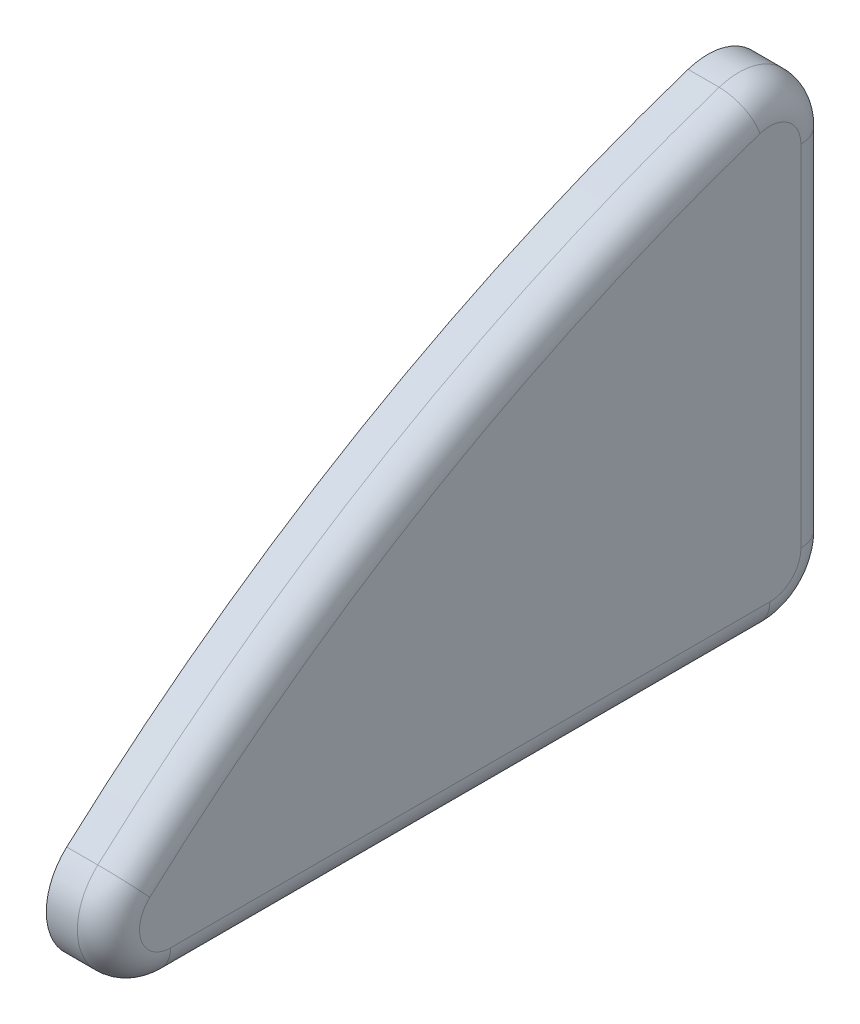
ISO-10303-21;
HEADER;
FILE_DESCRIPTION(('STEP AP214'),'2;1');
FILE_NAME('part.step','',(''),(''),'','','');
FILE_SCHEMA(('AUTOMOTIVE_DESIGN { 1 0 10303 214 1 1 1 1 }'));
ENDSEC;
DATA;
#1=APPLICATION_CONTEXT('core data for automotive mechanical design processes');
#2=APPLICATION_PROTOCOL_DEFINITION('international standard','automotive_design',2000,#1);
#3=PRODUCT_CONTEXT('',#1,'mechanical');
#4=PRODUCT('Part','Part','',(#3));
#5=PRODUCT_RELATED_PRODUCT_CATEGORY('part','',(#4));
#6=PRODUCT_DEFINITION_FORMATION('','',#4);
#7=PRODUCT_DEFINITION_CONTEXT('part definition',#1,'design');
#8=PRODUCT_DEFINITION('design','',#6,#7);
#9=PRODUCT_DEFINITION_SHAPE('','',#8);
#10=(LENGTH_UNIT() NAMED_UNIT(*) SI_UNIT(.MILLI.,.METRE.));
#11=(NAMED_UNIT(*) PLANE_ANGLE_UNIT() SI_UNIT($,.RADIAN.));
#12=(NAMED_UNIT(*) SI_UNIT($,.STERADIAN.) SOLID_ANGLE_UNIT());
#13=UNCERTAINTY_MEASURE_WITH_UNIT(LENGTH_MEASURE(1.E-05),#10,'distance_accuracy_value','');
#14=(GEOMETRIC_REPRESENTATION_CONTEXT(3) GLOBAL_UNCERTAINTY_ASSIGNED_CONTEXT((#13)) GLOBAL_UNIT_ASSIGNED_CONTEXT((#10,
#11,#12)) REPRESENTATION_CONTEXT('',''));
#15=CARTESIAN_POINT('',(0.,0.,0.));
#16=DIRECTION('',(0.,0.,1.));
#17=DIRECTION('',(1.,0.,0.));
#18=AXIS2_PLACEMENT_3D('',#15,#16,#17);
#19=CARTESIAN_POINT('',(14.999,-80.001,7.49999999999997));
#20=DIRECTION('',(0.,0.,-1.));
#21=DIRECTION('',(0.,1.,0.));
#22=AXIS2_PLACEMENT_3D('',#19,#20,#21);
#23=PLANE('',#22);
#24=DIRECTION('',(0.,-1.,0.));
#25=VECTOR('',#24,1.);
#26=CARTESIAN_POINT('',(15.,-77.1313506200373,7.49999999999997));
#27=LINE('',#26,#25);
#28=CARTESIAN_POINT('',(15.,-74.372865942521,7.49999999999997));
#29=VERTEX_POINT('',#28);
#30=CARTESIAN_POINT('',(15.,-80.,7.49999999999997));
#31=VERTEX_POINT('',#30);
#32=EDGE_CURVE('E178',#29,#31,#27,.T.);
#33=ORIENTED_EDGE('',*,*,#32,.F.);
#34=DIRECTION('',(-1.,0.,0.));
#35=VECTOR('',#34,1.);
#36=CARTESIAN_POINT('',(15.25,-74.372865942521,7.49999999999997));
#37=LINE('',#36,#35);
#38=CARTESIAN_POINT('',(15.5,-74.372865942521,7.49999999999997));
#39=VERTEX_POINT('',#38);
#40=EDGE_CURVE('E190',#39,#29,#37,.T.);
#41=ORIENTED_EDGE('',*,*,#40,.F.);
#42=DIRECTION('',(0.,1.,0.));
#43=VECTOR('',#42,1.);
#44=CARTESIAN_POINT('',(15.5,-77.1864329712605,7.49999999999997));
#45=LINE('',#44,#43);
#46=CARTESIAN_POINT('',(15.5,-80.,7.49999999999997));
#47=VERTEX_POINT('',#46);
#48=EDGE_CURVE('E162',#47,#39,#45,.T.);
#49=ORIENTED_EDGE('',*,*,#48,.F.);
#50=DIRECTION('',(1.,0.,0.));
#51=VECTOR('',#50,1.);
#52=CARTESIAN_POINT('',(15.25,-80.,7.49999999999997));
#53=LINE('',#52,#51);
#54=EDGE_CURVE('E168',#31,#47,#53,.T.);
#55=ORIENTED_EDGE('',*,*,#54,.F.);
#56=EDGE_LOOP('',(#33,#41,#49,#55));
#57=FACE_BOUND('',#56,.T.);
#58=ADVANCED_FACE('F17',(#57),#23,.T.);
#59=CARTESIAN_POINT('',(15.5,-74.372865942521,8.50000000000006));
#60=DIRECTION('',(-1.,0.,0.));
#61=DIRECTION('',(0.,0.,1.));
#62=AXIS2_PLACEMENT_3D('',#59,#60,#61);
#63=CYLINDRICAL_SURFACE('',#62,1.00000000000007);
#64=CARTESIAN_POINT('',(15.,-74.372865942521,8.50000000000006));
#65=DIRECTION('',(-1.,0.,0.));
#66=DIRECTION('',(0.,0.,1.));
#67=AXIS2_PLACEMENT_3D('',#64,#65,#66);
#68=CIRCLE('',#67,1.00000000000007);
#69=CARTESIAN_POINT('',(15.,-73.423712829281,8.81481481481484));
#70=VERTEX_POINT('',#69);
#71=EDGE_CURVE('E180',#70,#29,#68,.T.);
#72=ORIENTED_EDGE('',*,*,#71,.F.);
#73=DIRECTION('',(-1.,0.,0.));
#74=VECTOR('',#73,1.);
#75=CARTESIAN_POINT('',(15.25,-73.423712829281,8.81481481481478));
#76=LINE('',#75,#74);
#77=CARTESIAN_POINT('',(15.5,-73.423712829281,8.81481481481479));
#78=VERTEX_POINT('',#77);
#79=EDGE_CURVE('E183',#78,#70,#76,.T.);
#80=ORIENTED_EDGE('',*,*,#79,.F.);
#81=CARTESIAN_POINT('',(15.5,-74.372865942521,8.50000000000006));
#82=DIRECTION('',(1.,0.,0.));
#83=DIRECTION('',(0.,0.,-1.));
#84=AXIS2_PLACEMENT_3D('',#81,#82,#83);
#85=CIRCLE('',#84,1.00000000000008);
#86=EDGE_CURVE('E158',#39,#78,#85,.T.);
#87=ORIENTED_EDGE('',*,*,#86,.F.);
#88=ORIENTED_EDGE('',*,*,#40,.T.);
#89=EDGE_LOOP('',(#72,#80,#87,#88));
#90=FACE_BOUND('',#89,.T.);
#91=ADVANCED_FACE('F334',(#90),#63,.T.);
#92=CARTESIAN_POINT('',(15.5,-99.9999999999998,0.));
#93=DIRECTION('',(-1.,0.,0.));
#94=DIRECTION('',(0.,-1.,0.));
#95=AXIS2_PLACEMENT_3D('',#92,#93,#94);
#96=CYLINDRICAL_SURFACE('',#95,27.9999999999998);
#97=CARTESIAN_POINT('',(15.,-99.9999999999998,0.));
#98=DIRECTION('',(-1.,0.,0.));
#99=DIRECTION('',(0.,0.,1.));
#100=AXIS2_PLACEMENT_3D('',#97,#98,#99);
#101=CIRCLE('',#100,27.9999999999998);
#102=CARTESIAN_POINT('',(15.,-79.2592592592592,18.8101481526694));
#103=VERTEX_POINT('',#102);
#104=EDGE_CURVE('E201',#103,#70,#101,.T.);
#105=ORIENTED_EDGE('',*,*,#104,.F.);
#106=DIRECTION('',(-1.,0.,0.));
#107=VECTOR('',#106,1.);
#108=CARTESIAN_POINT('',(15.25,-79.2592592592592,18.8101481526694));
#109=LINE('',#108,#107);
#110=CARTESIAN_POINT('',(15.5,-79.2592592592592,18.8101481526694));
#111=VERTEX_POINT('',#110);
#112=EDGE_CURVE('E181',#111,#103,#109,.T.);
#113=ORIENTED_EDGE('',*,*,#112,.F.);
#114=CARTESIAN_POINT('',(15.5,-99.9999999999998,0.));
#115=DIRECTION('',(1.,0.,0.));
#116=DIRECTION('',(0.,0.949153113239962,0.314814814814819));
#117=AXIS2_PLACEMENT_3D('',#114,#115,#116);
#118=CIRCLE('',#117,27.9999999999998);
#119=EDGE_CURVE('E154',#78,#111,#118,.T.);
#120=ORIENTED_EDGE('',*,*,#119,.F.);
#121=ORIENTED_EDGE('',*,*,#79,.T.);
#122=EDGE_LOOP('',(#105,#113,#120,#121));
#123=FACE_BOUND('',#122,.T.);
#124=ADVANCED_FACE('F326',(#123),#96,.T.);
#125=CARTESIAN_POINT('',(15.5,-80.,18.1383571472169));
#126=DIRECTION('',(-1.,0.,0.));
#127=DIRECTION('',(0.,0.,1.));
#128=AXIS2_PLACEMENT_3D('',#125,#126,#127);
#129=CYLINDRICAL_SURFACE('',#128,0.999999999999997);
#130=CARTESIAN_POINT('',(15.,-80.,18.1383571472169));
#131=DIRECTION('',(-1.,0.,0.));
#132=DIRECTION('',(0.,0.,1.));
#133=AXIS2_PLACEMENT_3D('',#130,#131,#132);
#134=CIRCLE('',#133,0.999999999999997);
#135=CARTESIAN_POINT('',(15.,-80.9999999999999,18.1383571472169));
#136=VERTEX_POINT('',#135);
#137=EDGE_CURVE('E108',#136,#103,#134,.T.);
#138=ORIENTED_EDGE('',*,*,#137,.F.);
#139=DIRECTION('',(-1.,0.,0.));
#140=VECTOR('',#139,1.);
#141=CARTESIAN_POINT('',(15.25,-80.9999999999999,18.1383571472169));
#142=LINE('',#141,#140);
#143=CARTESIAN_POINT('',(15.5,-80.9999999999999,18.1383571472169));
#144=VERTEX_POINT('',#143);
#145=EDGE_CURVE('E103',#144,#136,#142,.T.);
#146=ORIENTED_EDGE('',*,*,#145,.F.);
#147=CARTESIAN_POINT('',(15.5,-80.,18.1383571472169));
#148=DIRECTION('',(1.,0.,0.));
#149=DIRECTION('',(0.,0.740740740740764,0.671791005452458));
#150=AXIS2_PLACEMENT_3D('',#147,#148,#149);
#151=CIRCLE('',#150,0.999999999999993);
#152=EDGE_CURVE('E106',#111,#144,#151,.T.);
#153=ORIENTED_EDGE('',*,*,#152,.F.);
#154=ORIENTED_EDGE('',*,*,#112,.T.);
#155=EDGE_LOOP('',(#138,#146,#153,#154));
#156=FACE_BOUND('',#155,.T.);
#157=ADVANCED_FACE('F105',(#156),#129,.T.);
#158=CARTESIAN_POINT('',(15.,-81.001,19.3192680852781));
#159=DIRECTION('',(-1.,0.,0.));
#160=DIRECTION('',(0.,1.,0.));
#161=AXIS2_PLACEMENT_3D('',#158,#159,#160);
#162=PLANE('',#161);
#163=ORIENTED_EDGE('',*,*,#71,.T.);
#164=ORIENTED_EDGE('',*,*,#32,.T.);
#165=CARTESIAN_POINT('',(15.,-80.,8.49999999999994));
#166=DIRECTION('',(-1.,0.,0.));
#167=DIRECTION('',(0.,0.,1.));
#168=AXIS2_PLACEMENT_3D('',#165,#166,#167);
#169=CIRCLE('',#168,0.999999999999972);
#170=CARTESIAN_POINT('',(15.,-81.,8.49999999999996));
#171=VERTEX_POINT('',#170);
#172=EDGE_CURVE('E171',#171,#31,#169,.F.);
#173=ORIENTED_EDGE('',*,*,#172,.F.);
#174=DIRECTION('',(0.,0.,-1.));
#175=VECTOR('',#174,1.);
#176=CARTESIAN_POINT('',(15.,-81.,13.3191785736084));
#177=LINE('',#176,#175);
#178=EDGE_CURVE('E113',#136,#171,#177,.T.);
#179=ORIENTED_EDGE('',*,*,#178,.F.);
#180=ORIENTED_EDGE('',*,*,#137,.T.);
#181=ORIENTED_EDGE('',*,*,#104,.T.);
#182=EDGE_LOOP('',(#163,#164,#173,#179,#180,#181));
#183=FACE_BOUND('',#182,.T.);
#184=ADVANCED_FACE('F234',(#183),#162,.T.);
#185=CARTESIAN_POINT('',(15.5,-80.,8.49999999999994));
#186=DIRECTION('',(-1.,0.,0.));
#187=DIRECTION('',(0.,0.,1.));
#188=AXIS2_PLACEMENT_3D('',#185,#186,#187);
#189=CYLINDRICAL_SURFACE('',#188,0.999999999999972);
#190=ORIENTED_EDGE('',*,*,#172,.T.);
#191=ORIENTED_EDGE('',*,*,#54,.T.);
#192=CARTESIAN_POINT('',(15.5,-80.,8.49999999999995));
#193=DIRECTION('',(1.,0.,0.));
#194=DIRECTION('',(0.,-1.,0.));
#195=AXIS2_PLACEMENT_3D('',#192,#193,#194);
#196=CIRCLE('',#195,0.999999999999976);
#197=CARTESIAN_POINT('',(15.5,-81.,8.49999999999997));
#198=VERTEX_POINT('',#197);
#199=EDGE_CURVE('E138',#198,#47,#196,.T.);
#200=ORIENTED_EDGE('',*,*,#199,.F.);
#201=DIRECTION('',(1.,0.,0.));
#202=VECTOR('',#201,1.);
#203=CARTESIAN_POINT('',(15.25,-81.,8.49999999999997));
#204=LINE('',#203,#202);
#205=EDGE_CURVE('E126',#171,#198,#204,.T.);
#206=ORIENTED_EDGE('',*,*,#205,.F.);
#207=EDGE_LOOP('',(#190,#191,#200,#206));
#208=FACE_BOUND('',#207,.T.);
#209=ADVANCED_FACE('F218',(#208),#189,.T.);
#210=CARTESIAN_POINT('',(15.5,-74.372865942521,7.99999999999998));
#211=DIRECTION('',(0.,-1.,0.));
#212=DIRECTION('',(0.,0.,-1.));
#213=AXIS2_PLACEMENT_3D('',#210,#211,#212);
#214=CYLINDRICAL_SURFACE('',#213,0.500000000000005);
#215=CARTESIAN_POINT('',(15.5,-80.,7.99999999999997));
#216=DIRECTION('',(0.,-1.,0.));
#217=DIRECTION('',(1.,0.,0.));
#218=AXIS2_PLACEMENT_3D('',#215,#216,#217);
#219=CIRCLE('',#218,0.500000000000001);
#220=CARTESIAN_POINT('',(16.,-80.,7.99999999999997));
#221=VERTEX_POINT('',#220);
#222=EDGE_CURVE('E141',#47,#221,#219,.T.);
#223=ORIENTED_EDGE('',*,*,#222,.F.);
#224=ORIENTED_EDGE('',*,*,#48,.T.);
#225=CARTESIAN_POINT('',(15.5,-74.372865942521,7.99999999999997));
#226=DIRECTION('',(0.,1.,0.));
#227=DIRECTION('',(1.,0.,0.));
#228=AXIS2_PLACEMENT_3D('',#225,#226,#227);
#229=CIRCLE('',#228,0.500000000000001);
#230=CARTESIAN_POINT('',(16.,-74.372865942521,7.99999999999997));
#231=VERTEX_POINT('',#230);
#232=EDGE_CURVE('E53',#231,#39,#229,.T.);
#233=ORIENTED_EDGE('',*,*,#232,.F.);
#234=DIRECTION('',(0.,1.,0.));
#235=VECTOR('',#234,1.);
#236=CARTESIAN_POINT('',(16.,-77.1588917956489,7.99999999999997));
#237=LINE('',#236,#235);
#238=EDGE_CURVE('E208',#221,#231,#237,.T.);
#239=ORIENTED_EDGE('',*,*,#238,.F.);
#240=EDGE_LOOP('',(#223,#224,#233,#239));
#241=FACE_BOUND('',#240,.T.);
#242=ADVANCED_FACE('F223',(#241),#214,.T.);
#243=CARTESIAN_POINT('',(15.5,-74.372865942521,8.5));
#244=DIRECTION('',(1.,0.,0.));
#245=DIRECTION('',(0.,0.,-1.));
#246=AXIS2_PLACEMENT_3D('',#243,#244,#245);
#247=TOROIDAL_SURFACE('',#246,0.500000000000033,0.500000000000001);
#248=ORIENTED_EDGE('',*,*,#232,.T.);
#249=ORIENTED_EDGE('',*,*,#86,.T.);
#250=CARTESIAN_POINT('',(15.5,-73.898289385901,8.65740740740737));
#251=DIRECTION('',(0.,-0.314814814814797,0.949153113239969));
#252=DIRECTION('',(1.,0.,0.));
#253=AXIS2_PLACEMENT_3D('',#250,#251,#252);
#254=CIRCLE('',#253,0.500000000000021);
#255=CARTESIAN_POINT('',(16.,-73.898289385901,8.6574074074074));
#256=VERTEX_POINT('',#255);
#257=EDGE_CURVE('E60',#256,#78,#254,.T.);
#258=ORIENTED_EDGE('',*,*,#257,.F.);
#259=CARTESIAN_POINT('',(16.,-74.372865942521,8.5));
#260=DIRECTION('',(1.,0.,0.));
#261=DIRECTION('',(0.,0.,-1.));
#262=AXIS2_PLACEMENT_3D('',#259,#260,#261);
#263=CIRCLE('',#262,0.500000000000033);
#264=EDGE_CURVE('E21',#231,#256,#263,.T.);
#265=ORIENTED_EDGE('',*,*,#264,.F.);
#266=EDGE_LOOP('',(#248,#249,#258,#265));
#267=FACE_BOUND('',#266,.T.);
#268=ADVANCED_FACE('F225',(#267),#247,.T.);
#269=CARTESIAN_POINT('',(15.5,-100.000000000002,-1.30971622436249E-12));
#270=DIRECTION('',(1.,0.,0.));
#271=DIRECTION('',(0.,0.,-1.));
#272=AXIS2_PLACEMENT_3D('',#269,#270,#271);
#273=TOROIDAL_SURFACE('',#272,27.5000000000023,0.500000000000021);
#274=CARTESIAN_POINT('',(15.5,-79.6296296296296,18.4742526499432));
#275=DIRECTION('',(0.,-0.67179100545242,0.740740740740798));
#276=DIRECTION('',(1.,0.,0.));
#277=AXIS2_PLACEMENT_3D('',#274,#275,#276);
#278=CIRCLE('',#277,0.499999999999999);
#279=CARTESIAN_POINT('',(16.,-79.6296296296296,18.4742526499432));
#280=VERTEX_POINT('',#279);
#281=EDGE_CURVE('E66',#280,#111,#278,.T.);
#282=ORIENTED_EDGE('',*,*,#281,.F.);
#283=CARTESIAN_POINT('',(16.,-100.000000000002,-1.30971622436249E-12));
#284=DIRECTION('',(1.,0.,0.));
#285=DIRECTION('',(0.,0.,-1.));
#286=AXIS2_PLACEMENT_3D('',#283,#284,#285);
#287=CIRCLE('',#286,27.5000000000023);
#288=EDGE_CURVE('E132',#256,#280,#287,.T.);
#289=ORIENTED_EDGE('',*,*,#288,.F.);
#290=ORIENTED_EDGE('',*,*,#257,.T.);
#291=ORIENTED_EDGE('',*,*,#119,.T.);
#292=EDGE_LOOP('',(#282,#289,#290,#291));
#293=FACE_BOUND('',#292,.T.);
#294=ADVANCED_FACE('F232',(#293),#273,.T.);
#295=CARTESIAN_POINT('',(15.5,-80.,18.1383571472169));
#296=DIRECTION('',(1.,0.,0.));
#297=DIRECTION('',(0.,0.,-1.));
#298=AXIS2_PLACEMENT_3D('',#295,#296,#297);
#299=TOROIDAL_SURFACE('',#298,0.500000000000034,0.499999999999999);
#300=CARTESIAN_POINT('',(15.5,-80.4999999999999,18.1383571472169));
#301=DIRECTION('',(0.,0.,-1.));
#302=DIRECTION('',(1.,0.,0.));
#303=AXIS2_PLACEMENT_3D('',#300,#301,#302);
#304=CIRCLE('',#303,0.5);
#305=CARTESIAN_POINT('',(16.,-80.4999999999999,18.1383571472169));
#306=VERTEX_POINT('',#305);
#307=EDGE_CURVE('E118',#306,#144,#304,.T.);
#308=ORIENTED_EDGE('',*,*,#307,.F.);
#309=CARTESIAN_POINT('',(16.,-80.,18.1383571472169));
#310=DIRECTION('',(1.,0.,0.));
#311=DIRECTION('',(0.,0.,-1.));
#312=AXIS2_PLACEMENT_3D('',#309,#310,#311);
#313=CIRCLE('',#312,0.500000000000034);
#314=EDGE_CURVE('E130',#280,#306,#313,.T.);
#315=ORIENTED_EDGE('',*,*,#314,.F.);
#316=ORIENTED_EDGE('',*,*,#281,.T.);
#317=ORIENTED_EDGE('',*,*,#152,.T.);
#318=EDGE_LOOP('',(#308,#315,#316,#317));
#319=FACE_BOUND('',#318,.T.);
#320=ADVANCED_FACE('F116',(#319),#299,.T.);
#321=CARTESIAN_POINT('',(14.999,-80.9999999999999,18.1393571472169));
#322=DIRECTION('',(0.,-1.,0.));
#323=DIRECTION('',(0.,0.,-1.));
#324=AXIS2_PLACEMENT_3D('',#321,#322,#323);
#325=PLANE('',#324);
#326=ORIENTED_EDGE('',*,*,#178,.T.);
#327=ORIENTED_EDGE('',*,*,#205,.T.);
#328=DIRECTION('',(0.,0.,-1.));
#329=VECTOR('',#328,1.);
#330=CARTESIAN_POINT('',(15.5,-81.,13.3191785736084));
#331=LINE('',#330,#329);
#332=EDGE_CURVE('E123',#144,#198,#331,.T.);
#333=ORIENTED_EDGE('',*,*,#332,.F.);
#334=ORIENTED_EDGE('',*,*,#145,.T.);
#335=EDGE_LOOP('',(#326,#327,#333,#334));
#336=FACE_BOUND('',#335,.T.);
#337=ADVANCED_FACE('F124',(#336),#325,.T.);
#338=CARTESIAN_POINT('',(15.5,-80.,8.49999999999995));
#339=DIRECTION('',(1.,0.,0.));
#340=DIRECTION('',(0.,0.,-1.));
#341=AXIS2_PLACEMENT_3D('',#338,#339,#340);
#342=DEGENERATE_TOROIDAL_SURFACE('',#341,0.499999999999987,0.5,.T.);
#343=CARTESIAN_POINT('',(15.5,-80.5,8.49999999999997));
#344=DIRECTION('',(0.,0.,1.));
#345=DIRECTION('',(1.,0.,0.));
#346=AXIS2_PLACEMENT_3D('',#343,#344,#345);
#347=CIRCLE('',#346,0.5);
#348=CARTESIAN_POINT('',(16.,-80.5,8.49999999999996));
#349=VERTEX_POINT('',#348);
#350=EDGE_CURVE('E27',#198,#349,#347,.T.);
#351=ORIENTED_EDGE('',*,*,#350,.F.);
#352=ORIENTED_EDGE('',*,*,#199,.T.);
#353=ORIENTED_EDGE('',*,*,#222,.T.);
#354=CARTESIAN_POINT('',(16.,-80.,8.49999999999995));
#355=DIRECTION('',(1.,0.,0.));
#356=DIRECTION('',(0.,0.,-1.));
#357=AXIS2_PLACEMENT_3D('',#354,#355,#356);
#358=CIRCLE('',#357,0.499999999999987);
#359=EDGE_CURVE('E36',#349,#221,#358,.T.);
#360=ORIENTED_EDGE('',*,*,#359,.F.);
#361=EDGE_LOOP('',(#351,#352,#353,#360));
#362=FACE_BOUND('',#361,.T.);
#363=ADVANCED_FACE('F215',(#362),#342,.T.);
#364=CARTESIAN_POINT('',(16.,-73.8167835912979,18.7293126162475));
#365=DIRECTION('',(1.,0.,0.));
#366=DIRECTION('',(0.,-1.,0.));
#367=AXIS2_PLACEMENT_3D('',#364,#365,#366);
#368=PLANE('',#367);
#369=ORIENTED_EDGE('',*,*,#288,.T.);
#370=ORIENTED_EDGE('',*,*,#314,.T.);
#371=DIRECTION('',(0.,0.,1.));
#372=VECTOR('',#371,1.);
#373=CARTESIAN_POINT('',(16.,-80.5,13.3191785736084));
#374=LINE('',#373,#372);
#375=EDGE_CURVE('E11',#349,#306,#374,.T.);
#376=ORIENTED_EDGE('',*,*,#375,.F.);
#377=ORIENTED_EDGE('',*,*,#359,.T.);
#378=ORIENTED_EDGE('',*,*,#238,.T.);
#379=ORIENTED_EDGE('',*,*,#264,.T.);
#380=EDGE_LOOP('',(#369,#370,#376,#377,#378,#379));
#381=FACE_BOUND('',#380,.T.);
#382=ADVANCED_FACE('F237',(#381),#368,.T.);
#383=CARTESIAN_POINT('',(15.5,-80.5,8.49999999999997));
#384=DIRECTION('',(0.,0.,1.));
#385=DIRECTION('',(1.,0.,0.));
#386=AXIS2_PLACEMENT_3D('',#383,#384,#385);
#387=CYLINDRICAL_SURFACE('',#386,0.5);
#388=ORIENTED_EDGE('',*,*,#350,.T.);
#389=ORIENTED_EDGE('',*,*,#375,.T.);
#390=ORIENTED_EDGE('',*,*,#307,.T.);
#391=ORIENTED_EDGE('',*,*,#332,.T.);
#392=EDGE_LOOP('',(#388,#389,#390,#391));
#393=FACE_BOUND('',#392,.T.);
#394=ADVANCED_FACE('F19',(#393),#387,.T.);
#395=CLOSED_SHELL('',(#58,#91,#124,#157,#184,#209,#242,#268,#294,#320,#337,#363,#382,#394));
#396=MANIFOLD_SOLID_BREP('B1',#395);
#397=ADVANCED_BREP_SHAPE_REPRESENTATION('',(#18,#396),#14);
#398=SHAPE_DEFINITION_REPRESENTATION(#9,#397);
ENDSEC;
END-ISO-10303-21;
